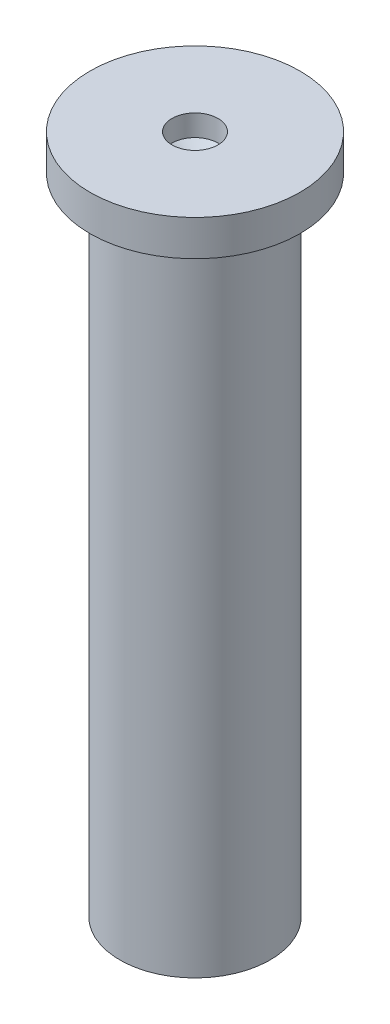
ISO-10303-21;
HEADER;
FILE_DESCRIPTION(('STEP AP214'),'2;1');
FILE_NAME('part.step','',(''),(''),'','','');
FILE_SCHEMA(('AUTOMOTIVE_DESIGN { 1 0 10303 214 1 1 1 1 }'));
ENDSEC;
DATA;
#1=APPLICATION_CONTEXT('core data for automotive mechanical design processes');
#2=APPLICATION_PROTOCOL_DEFINITION('international standard','automotive_design',2000,#1);
#3=PRODUCT_CONTEXT('',#1,'mechanical');
#4=PRODUCT('Part','Part','',(#3));
#5=PRODUCT_RELATED_PRODUCT_CATEGORY('part','',(#4));
#6=PRODUCT_DEFINITION_FORMATION('','',#4);
#7=PRODUCT_DEFINITION_CONTEXT('part definition',#1,'design');
#8=PRODUCT_DEFINITION('design','',#6,#7);
#9=PRODUCT_DEFINITION_SHAPE('','',#8);
#10=(LENGTH_UNIT() NAMED_UNIT(*) SI_UNIT(.MILLI.,.METRE.));
#11=(NAMED_UNIT(*) PLANE_ANGLE_UNIT() SI_UNIT($,.RADIAN.));
#12=(NAMED_UNIT(*) SI_UNIT($,.STERADIAN.) SOLID_ANGLE_UNIT());
#13=UNCERTAINTY_MEASURE_WITH_UNIT(LENGTH_MEASURE(1.E-05),#10,'distance_accuracy_value','');
#14=(GEOMETRIC_REPRESENTATION_CONTEXT(3) GLOBAL_UNCERTAINTY_ASSIGNED_CONTEXT((#13)) GLOBAL_UNIT_ASSIGNED_CONTEXT((#10,
#11,#12)) REPRESENTATION_CONTEXT('',''));
#15=CARTESIAN_POINT('',(0.,0.,0.));
#16=DIRECTION('',(0.,0.,1.));
#17=DIRECTION('',(1.,0.,0.));
#18=AXIS2_PLACEMENT_3D('',#15,#16,#17);
#19=CARTESIAN_POINT('',(0.,0.,0.));
#20=DIRECTION('',(0.,-1.,0.));
#21=DIRECTION('',(0.,0.,-1.));
#22=AXIS2_PLACEMENT_3D('',#19,#20,#21);
#23=PLANE('',#22);
#24=CARTESIAN_POINT('',(0.,0.,0.));
#25=DIRECTION('',(0.,-1.,0.));
#26=DIRECTION('',(0.,0.,-1.));
#27=AXIS2_PLACEMENT_3D('',#24,#25,#26);
#28=CIRCLE('',#27,1.05);
#29=CARTESIAN_POINT('',(0.,0.,-1.05));
#30=VERTEX_POINT('',#29);
#31=EDGE_CURVE('E11',#30,#30,#28,.T.);
#32=ORIENTED_EDGE('',*,*,#31,.T.);
#33=EDGE_LOOP('',(#32));
#34=FACE_BOUND('',#33,.T.);
#35=ADVANCED_FACE('F39',(#34),#23,.T.);
#36=CARTESIAN_POINT('',(0.,0.,0.));
#37=DIRECTION('',(0.,-1.,0.));
#38=DIRECTION('',(0.,0.,-1.));
#39=AXIS2_PLACEMENT_3D('',#36,#37,#38);
#40=CYLINDRICAL_SURFACE('',#39,1.05);
#41=CARTESIAN_POINT('',(0.,9.,0.));
#42=DIRECTION('',(0.,-1.,0.));
#43=DIRECTION('',(0.,0.,-1.));
#44=AXIS2_PLACEMENT_3D('',#41,#42,#43);
#45=CIRCLE('',#44,1.05);
#46=CARTESIAN_POINT('',(0.,9.,-1.05));
#47=VERTEX_POINT('',#46);
#48=EDGE_CURVE('E46',#47,#47,#45,.T.);
#49=ORIENTED_EDGE('',*,*,#48,.T.);
#50=EDGE_LOOP('',(#49));
#51=FACE_BOUND('',#50,.T.);
#52=ORIENTED_EDGE('',*,*,#31,.F.);
#53=EDGE_LOOP('',(#52));
#54=FACE_BOUND('',#53,.T.);
#55=ADVANCED_FACE('F76',(#51,#54),#40,.T.);
#56=CARTESIAN_POINT('',(1.05,9.,0.));
#57=DIRECTION('',(0.,-1.,0.));
#58=DIRECTION('',(0.,0.,-1.));
#59=AXIS2_PLACEMENT_3D('',#56,#57,#58);
#60=PLANE('',#59);
#61=CARTESIAN_POINT('',(0.,9.,0.));
#62=DIRECTION('',(0.,-1.,0.));
#63=DIRECTION('',(0.,0.,-1.));
#64=AXIS2_PLACEMENT_3D('',#61,#62,#63);
#65=CIRCLE('',#64,1.46817232814613);
#66=CARTESIAN_POINT('',(0.,9.,-1.46817232814613));
#67=VERTEX_POINT('',#66);
#68=EDGE_CURVE('E69',#67,#67,#65,.T.);
#69=ORIENTED_EDGE('',*,*,#68,.T.);
#70=EDGE_LOOP('',(#69));
#71=FACE_BOUND('',#70,.T.);
#72=ORIENTED_EDGE('',*,*,#48,.F.);
#73=EDGE_LOOP('',(#72));
#74=FACE_BOUND('',#73,.T.);
#75=ADVANCED_FACE('F79',(#71,#74),#60,.T.);
#76=CARTESIAN_POINT('',(0.,0.,0.));
#77=DIRECTION('',(0.,-1.,0.));
#78=DIRECTION('',(0.,0.,-1.));
#79=AXIS2_PLACEMENT_3D('',#76,#77,#78);
#80=CYLINDRICAL_SURFACE('',#79,1.46817232814613);
#81=CARTESIAN_POINT('',(0.,9.5,0.));
#82=DIRECTION('',(0.,-1.,0.));
#83=DIRECTION('',(0.,0.,-1.));
#84=AXIS2_PLACEMENT_3D('',#81,#82,#83);
#85=CIRCLE('',#84,1.46817232814613);
#86=CARTESIAN_POINT('',(0.,9.5,-1.46817232814613));
#87=VERTEX_POINT('',#86);
#88=EDGE_CURVE('E63',#87,#87,#85,.T.);
#89=ORIENTED_EDGE('',*,*,#88,.T.);
#90=EDGE_LOOP('',(#89));
#91=FACE_BOUND('',#90,.T.);
#92=ORIENTED_EDGE('',*,*,#68,.F.);
#93=EDGE_LOOP('',(#92));
#94=FACE_BOUND('',#93,.T.);
#95=ADVANCED_FACE('F81',(#91,#94),#80,.T.);
#96=CARTESIAN_POINT('',(1.46817232814613,9.5,0.));
#97=DIRECTION('',(0.,1.,0.));
#98=DIRECTION('',(0.,0.,1.));
#99=AXIS2_PLACEMENT_3D('',#96,#97,#98);
#100=PLANE('',#99);
#101=CARTESIAN_POINT('',(0.,9.5,0.));
#102=DIRECTION('',(0.,-1.,0.));
#103=DIRECTION('',(0.,0.,-1.));
#104=AXIS2_PLACEMENT_3D('',#101,#102,#103);
#105=CIRCLE('',#104,0.321215791877372);
#106=CARTESIAN_POINT('',(0.,9.5,-0.321215791877372));
#107=VERTEX_POINT('',#106);
#108=EDGE_CURVE('E59',#107,#107,#105,.T.);
#109=ORIENTED_EDGE('',*,*,#108,.T.);
#110=EDGE_LOOP('',(#109));
#111=FACE_BOUND('',#110,.T.);
#112=ORIENTED_EDGE('',*,*,#88,.F.);
#113=EDGE_LOOP('',(#112));
#114=FACE_BOUND('',#113,.T.);
#115=ADVANCED_FACE('F88',(#111,#114),#100,.T.);
#116=CARTESIAN_POINT('',(0.,0.,0.));
#117=DIRECTION('',(0.,-1.,0.));
#118=DIRECTION('',(0.,0.,-1.));
#119=AXIS2_PLACEMENT_3D('',#116,#117,#118);
#120=CYLINDRICAL_SURFACE('',#119,0.321215791877372);
#121=CARTESIAN_POINT('',(0.,9.20146170981971,0.));
#122=DIRECTION('',(0.,-1.,0.));
#123=DIRECTION('',(0.,0.,-1.));
#124=AXIS2_PLACEMENT_3D('',#121,#122,#123);
#125=CIRCLE('',#124,0.321215791877372);
#126=CARTESIAN_POINT('',(0.,9.20146170981971,-0.321215791877372));
#127=VERTEX_POINT('',#126);
#128=EDGE_CURVE('E56',#127,#127,#125,.T.);
#129=ORIENTED_EDGE('',*,*,#128,.T.);
#130=EDGE_LOOP('',(#129));
#131=FACE_BOUND('',#130,.T.);
#132=ORIENTED_EDGE('',*,*,#108,.F.);
#133=EDGE_LOOP('',(#132));
#134=FACE_BOUND('',#133,.T.);
#135=ADVANCED_FACE('F52',(#131,#134),#120,.F.);
#136=CARTESIAN_POINT('',(0.,9.20146170981971,0.));
#137=DIRECTION('',(0.,1.,0.));
#138=DIRECTION('',(0.,0.,1.));
#139=AXIS2_PLACEMENT_3D('',#136,#137,#138);
#140=CONICAL_SURFACE('',#139,0.321215791877372,1.01062735536984);
#141=CARTESIAN_POINT('',(0.,9.,0.));
#142=VERTEX_POINT('',#141);
#143=VERTEX_LOOP('',#142);
#144=FACE_BOUND('',#143,.T.);
#145=ORIENTED_EDGE('',*,*,#128,.F.);
#146=EDGE_LOOP('',(#145));
#147=FACE_BOUND('',#146,.T.);
#148=ADVANCED_FACE('F49',(#144,#147),#140,.F.);
#149=CLOSED_SHELL('',(#35,#55,#75,#95,#115,#135,#148));
#150=MANIFOLD_SOLID_BREP('B2',#149);
#151=ADVANCED_BREP_SHAPE_REPRESENTATION('',(#18,#150),#14);
#152=SHAPE_DEFINITION_REPRESENTATION(#9,#151);
ENDSEC;
END-ISO-10303-21;
